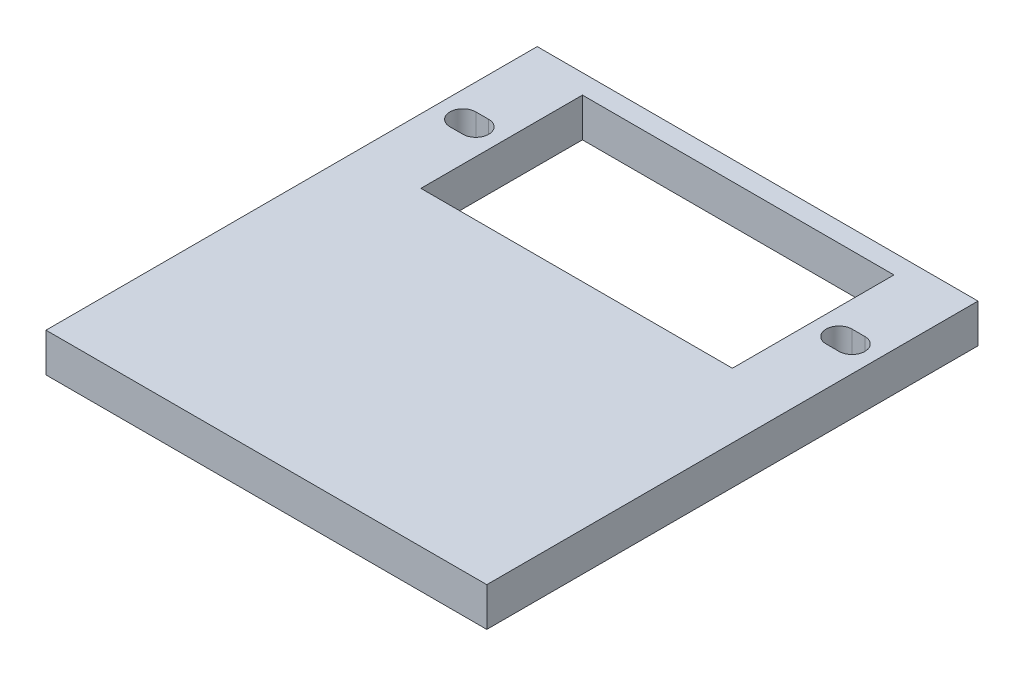
ISO-10303-21;
HEADER;
FILE_DESCRIPTION(('STEP AP214'),'2;1');
FILE_NAME('part.step','',(''),(''),'','','');
FILE_SCHEMA(('AUTOMOTIVE_DESIGN { 1 0 10303 214 1 1 1 1 }'));
ENDSEC;
DATA;
#1=APPLICATION_CONTEXT('core data for automotive mechanical design processes');
#2=APPLICATION_PROTOCOL_DEFINITION('international standard','automotive_design',2000,#1);
#3=PRODUCT_CONTEXT('',#1,'mechanical');
#4=PRODUCT('Part','Part','',(#3));
#5=PRODUCT_RELATED_PRODUCT_CATEGORY('part','',(#4));
#6=PRODUCT_DEFINITION_FORMATION('','',#4);
#7=PRODUCT_DEFINITION_CONTEXT('part definition',#1,'design');
#8=PRODUCT_DEFINITION('design','',#6,#7);
#9=PRODUCT_DEFINITION_SHAPE('','',#8);
#10=(LENGTH_UNIT() NAMED_UNIT(*) SI_UNIT(.MILLI.,.METRE.));
#11=(NAMED_UNIT(*) PLANE_ANGLE_UNIT() SI_UNIT($,.RADIAN.));
#12=(NAMED_UNIT(*) SI_UNIT($,.STERADIAN.) SOLID_ANGLE_UNIT());
#13=UNCERTAINTY_MEASURE_WITH_UNIT(LENGTH_MEASURE(1.E-05),#10,'distance_accuracy_value','');
#14=(GEOMETRIC_REPRESENTATION_CONTEXT(3) GLOBAL_UNCERTAINTY_ASSIGNED_CONTEXT((#13)) GLOBAL_UNIT_ASSIGNED_CONTEXT((#10,
#11,#12)) REPRESENTATION_CONTEXT('',''));
#15=CARTESIAN_POINT('',(0.,0.,0.));
#16=DIRECTION('',(0.,0.,1.));
#17=DIRECTION('',(1.,0.,0.));
#18=AXIS2_PLACEMENT_3D('',#15,#16,#17);
#19=CARTESIAN_POINT('',(0.,3.,-24.));
#20=DIRECTION('',(0.,0.,1.));
#21=DIRECTION('',(1.,0.,0.));
#22=AXIS2_PLACEMENT_3D('',#19,#20,#21);
#23=PLANE('',#22);
#24=DIRECTION('',(-1.,0.,0.));
#25=VECTOR('',#24,1.);
#26=CARTESIAN_POINT('',(0.,0.,-24.));
#27=LINE('',#26,#25);
#28=CARTESIAN_POINT('',(12.05,0.,-24.));
#29=VERTEX_POINT('',#28);
#30=CARTESIAN_POINT('',(-12.05,0.,-24.));
#31=VERTEX_POINT('',#30);
#32=EDGE_CURVE('E161',#29,#31,#27,.T.);
#33=ORIENTED_EDGE('',*,*,#32,.T.);
#34=DIRECTION('',(0.,-1.,0.));
#35=VECTOR('',#34,1.);
#36=CARTESIAN_POINT('',(-12.05,3.,-24.));
#37=LINE('',#36,#35);
#38=CARTESIAN_POINT('',(-12.05,3.,-24.));
#39=VERTEX_POINT('',#38);
#40=EDGE_CURVE('E11',#39,#31,#37,.T.);
#41=ORIENTED_EDGE('',*,*,#40,.F.);
#42=DIRECTION('',(-1.,0.,0.));
#43=VECTOR('',#42,1.);
#44=CARTESIAN_POINT('',(0.,3.,-24.));
#45=LINE('',#44,#43);
#46=CARTESIAN_POINT('',(12.05,3.,-24.));
#47=VERTEX_POINT('',#46);
#48=EDGE_CURVE('E131',#47,#39,#45,.T.);
#49=ORIENTED_EDGE('',*,*,#48,.F.);
#50=DIRECTION('',(0.,-1.,0.));
#51=VECTOR('',#50,1.);
#52=CARTESIAN_POINT('',(12.05,3.,-24.));
#53=LINE('',#52,#51);
#54=EDGE_CURVE('E211',#47,#29,#53,.T.);
#55=ORIENTED_EDGE('',*,*,#54,.T.);
#56=EDGE_LOOP('',(#33,#41,#49,#55));
#57=FACE_BOUND('',#56,.T.);
#58=ADVANCED_FACE('F35',(#57),#23,.F.);
#59=CARTESIAN_POINT('',(-12.05,3.,0.));
#60=DIRECTION('',(1.,0.,0.));
#61=DIRECTION('',(0.,0.,-1.));
#62=AXIS2_PLACEMENT_3D('',#59,#60,#61);
#63=PLANE('',#62);
#64=DIRECTION('',(0.,0.,1.));
#65=VECTOR('',#64,1.);
#66=CARTESIAN_POINT('',(-12.05,0.,0.));
#67=LINE('',#66,#65);
#68=CARTESIAN_POINT('',(-12.05,0.,-36.5));
#69=VERTEX_POINT('',#68);
#70=EDGE_CURVE('E116',#69,#31,#67,.T.);
#71=ORIENTED_EDGE('',*,*,#70,.F.);
#72=DIRECTION('',(0.,-1.,0.));
#73=VECTOR('',#72,1.);
#74=CARTESIAN_POINT('',(-12.05,3.,-36.5));
#75=LINE('',#74,#73);
#76=CARTESIAN_POINT('',(-12.05,3.,-36.5));
#77=VERTEX_POINT('',#76);
#78=EDGE_CURVE('E45',#77,#69,#75,.T.);
#79=ORIENTED_EDGE('',*,*,#78,.F.);
#80=DIRECTION('',(0.,0.,1.));
#81=VECTOR('',#80,1.);
#82=CARTESIAN_POINT('',(-12.05,3.,0.));
#83=LINE('',#82,#81);
#84=EDGE_CURVE('E114',#77,#39,#83,.T.);
#85=ORIENTED_EDGE('',*,*,#84,.T.);
#86=ORIENTED_EDGE('',*,*,#40,.T.);
#87=EDGE_LOOP('',(#71,#79,#85,#86));
#88=FACE_BOUND('',#87,.T.);
#89=ADVANCED_FACE('F113',(#88),#63,.T.);
#90=CARTESIAN_POINT('',(0.,3.,-36.5));
#91=DIRECTION('',(0.,0.,1.));
#92=DIRECTION('',(1.,0.,0.));
#93=AXIS2_PLACEMENT_3D('',#90,#91,#92);
#94=PLANE('',#93);
#95=DIRECTION('',(-1.,0.,0.));
#96=VECTOR('',#95,1.);
#97=CARTESIAN_POINT('',(0.,0.,-36.5));
#98=LINE('',#97,#96);
#99=CARTESIAN_POINT('',(12.05,0.,-36.5));
#100=VERTEX_POINT('',#99);
#101=EDGE_CURVE('E165',#100,#69,#98,.T.);
#102=ORIENTED_EDGE('',*,*,#101,.F.);
#103=DIRECTION('',(0.,-1.,0.));
#104=VECTOR('',#103,1.);
#105=CARTESIAN_POINT('',(12.05,3.,-36.5));
#106=LINE('',#105,#104);
#107=CARTESIAN_POINT('',(12.05,3.,-36.5));
#108=VERTEX_POINT('',#107);
#109=EDGE_CURVE('E137',#108,#100,#106,.T.);
#110=ORIENTED_EDGE('',*,*,#109,.F.);
#111=DIRECTION('',(-1.,0.,0.));
#112=VECTOR('',#111,1.);
#113=CARTESIAN_POINT('',(0.,3.,-36.5));
#114=LINE('',#113,#112);
#115=EDGE_CURVE('E128',#108,#77,#114,.T.);
#116=ORIENTED_EDGE('',*,*,#115,.T.);
#117=ORIENTED_EDGE('',*,*,#78,.T.);
#118=EDGE_LOOP('',(#102,#110,#116,#117));
#119=FACE_BOUND('',#118,.T.);
#120=ADVANCED_FACE('F135',(#119),#94,.T.);
#121=CARTESIAN_POINT('',(0.,3.,-38.));
#122=DIRECTION('',(0.,0.,1.));
#123=DIRECTION('',(1.,0.,0.));
#124=AXIS2_PLACEMENT_3D('',#121,#122,#123);
#125=PLANE('',#124);
#126=DIRECTION('',(-1.,0.,0.));
#127=VECTOR('',#126,1.);
#128=CARTESIAN_POINT('',(0.,0.,-38.));
#129=LINE('',#128,#127);
#130=CARTESIAN_POINT('',(17.05,0.,-38.));
#131=VERTEX_POINT('',#130);
#132=CARTESIAN_POINT('',(-17.05,0.,-38.));
#133=VERTEX_POINT('',#132);
#134=EDGE_CURVE('E167',#131,#133,#129,.T.);
#135=ORIENTED_EDGE('',*,*,#134,.T.);
#136=DIRECTION('',(0.,-1.,0.));
#137=VECTOR('',#136,1.);
#138=CARTESIAN_POINT('',(-17.05,3.,-38.));
#139=LINE('',#138,#137);
#140=CARTESIAN_POINT('',(-17.05,3.,-38.));
#141=VERTEX_POINT('',#140);
#142=EDGE_CURVE('E81',#141,#133,#139,.T.);
#143=ORIENTED_EDGE('',*,*,#142,.F.);
#144=DIRECTION('',(-1.,0.,0.));
#145=VECTOR('',#144,1.);
#146=CARTESIAN_POINT('',(0.,3.,-38.));
#147=LINE('',#146,#145);
#148=CARTESIAN_POINT('',(17.05,3.,-38.));
#149=VERTEX_POINT('',#148);
#150=EDGE_CURVE('E138',#149,#141,#147,.T.);
#151=ORIENTED_EDGE('',*,*,#150,.F.);
#152=DIRECTION('',(0.,-1.,0.));
#153=VECTOR('',#152,1.);
#154=CARTESIAN_POINT('',(17.05,3.,-38.));
#155=LINE('',#154,#153);
#156=EDGE_CURVE('E224',#149,#131,#155,.T.);
#157=ORIENTED_EDGE('',*,*,#156,.T.);
#158=EDGE_LOOP('',(#135,#143,#151,#157));
#159=FACE_BOUND('',#158,.T.);
#160=ADVANCED_FACE('F348',(#159),#125,.F.);
#161=CARTESIAN_POINT('',(-17.05,3.,0.));
#162=DIRECTION('',(-1.,0.,0.));
#163=DIRECTION('',(0.,0.,1.));
#164=AXIS2_PLACEMENT_3D('',#161,#162,#163);
#165=PLANE('',#164);
#166=DIRECTION('',(0.,0.,-1.));
#167=VECTOR('',#166,1.);
#168=CARTESIAN_POINT('',(-17.05,0.,0.));
#169=LINE('',#168,#167);
#170=CARTESIAN_POINT('',(-17.05,0.,0.));
#171=VERTEX_POINT('',#170);
#172=EDGE_CURVE('E169',#171,#133,#169,.T.);
#173=ORIENTED_EDGE('',*,*,#172,.F.);
#174=DIRECTION('',(0.,-1.,0.));
#175=VECTOR('',#174,1.);
#176=CARTESIAN_POINT('',(-17.05,3.,0.));
#177=LINE('',#176,#175);
#178=CARTESIAN_POINT('',(-17.05,3.,0.));
#179=VERTEX_POINT('',#178);
#180=EDGE_CURVE('E54',#179,#171,#177,.T.);
#181=ORIENTED_EDGE('',*,*,#180,.F.);
#182=DIRECTION('',(0.,0.,-1.));
#183=VECTOR('',#182,1.);
#184=CARTESIAN_POINT('',(-17.05,3.,0.));
#185=LINE('',#184,#183);
#186=EDGE_CURVE('E140',#179,#141,#185,.T.);
#187=ORIENTED_EDGE('',*,*,#186,.T.);
#188=ORIENTED_EDGE('',*,*,#142,.T.);
#189=EDGE_LOOP('',(#173,#181,#187,#188));
#190=FACE_BOUND('',#189,.T.);
#191=ADVANCED_FACE('F344',(#190),#165,.T.);
#192=CARTESIAN_POINT('',(-14.05,3.,-30.25));
#193=DIRECTION('',(0.,-1.,0.));
#194=DIRECTION('',(0.,0.,-1.));
#195=AXIS2_PLACEMENT_3D('',#192,#193,#194);
#196=CYLINDRICAL_SURFACE('',#195,1.);
#197=CARTESIAN_POINT('',(-14.05,0.,-30.25));
#198=DIRECTION('',(0.,1.,0.));
#199=DIRECTION('',(0.,0.,1.));
#200=AXIS2_PLACEMENT_3D('',#197,#198,#199);
#201=CIRCLE('',#200,1.);
#202=CARTESIAN_POINT('',(-14.05,0.,-29.25));
#203=VERTEX_POINT('',#202);
#204=CARTESIAN_POINT('',(-14.05,0.,-31.25));
#205=VERTEX_POINT('',#204);
#206=EDGE_CURVE('E148',#203,#205,#201,.T.);
#207=ORIENTED_EDGE('',*,*,#206,.F.);
#208=DIRECTION('',(0.,-1.,0.));
#209=VECTOR('',#208,1.);
#210=CARTESIAN_POINT('',(-14.05,3.,-29.25));
#211=LINE('',#210,#209);
#212=CARTESIAN_POINT('',(-14.05,3.,-29.25));
#213=VERTEX_POINT('',#212);
#214=EDGE_CURVE('E39',#213,#203,#211,.T.);
#215=ORIENTED_EDGE('',*,*,#214,.F.);
#216=CARTESIAN_POINT('',(-14.05,3.,-30.25));
#217=DIRECTION('',(0.,1.,0.));
#218=DIRECTION('',(0.,0.,1.));
#219=AXIS2_PLACEMENT_3D('',#216,#217,#218);
#220=CIRCLE('',#219,1.);
#221=CARTESIAN_POINT('',(-14.05,3.,-31.25));
#222=VERTEX_POINT('',#221);
#223=EDGE_CURVE('E175',#213,#222,#220,.T.);
#224=ORIENTED_EDGE('',*,*,#223,.T.);
#225=DIRECTION('',(0.,-1.,0.));
#226=VECTOR('',#225,1.);
#227=CARTESIAN_POINT('',(-14.05,3.,-31.25));
#228=LINE('',#227,#226);
#229=EDGE_CURVE('E147',#222,#205,#228,.T.);
#230=ORIENTED_EDGE('',*,*,#229,.T.);
#231=EDGE_LOOP('',(#207,#215,#224,#230));
#232=FACE_BOUND('',#231,.T.);
#233=ADVANCED_FACE('F37',(#232),#196,.F.);
#234=CARTESIAN_POINT('',(1.01481323344643E-13,3.,-29.2499999999999));
#235=DIRECTION('',(0.,0.,-1.));
#236=DIRECTION('',(-1.,0.,0.));
#237=AXIS2_PLACEMENT_3D('',#234,#235,#236);
#238=PLANE('',#237);
#239=DIRECTION('',(1.,0.,0.));
#240=VECTOR('',#239,1.);
#241=CARTESIAN_POINT('',(1.01481323344643E-13,0.,-29.2499999999999));
#242=LINE('',#241,#240);
#243=CARTESIAN_POINT('',(-15.05,0.,-29.25));
#244=VERTEX_POINT('',#243);
#245=EDGE_CURVE('E151',#244,#203,#242,.T.);
#246=ORIENTED_EDGE('',*,*,#245,.F.);
#247=DIRECTION('',(0.,-1.,0.));
#248=VECTOR('',#247,1.);
#249=CARTESIAN_POINT('',(-15.05,3.,-29.25));
#250=LINE('',#249,#248);
#251=CARTESIAN_POINT('',(-15.05,3.,-29.25));
#252=VERTEX_POINT('',#251);
#253=EDGE_CURVE('E180',#252,#244,#250,.T.);
#254=ORIENTED_EDGE('',*,*,#253,.F.);
#255=DIRECTION('',(1.,0.,0.));
#256=VECTOR('',#255,1.);
#257=CARTESIAN_POINT('',(1.01481323344643E-13,3.,-29.2499999999999));
#258=LINE('',#257,#256);
#259=EDGE_CURVE('E189',#252,#213,#258,.T.);
#260=ORIENTED_EDGE('',*,*,#259,.T.);
#261=ORIENTED_EDGE('',*,*,#214,.T.);
#262=EDGE_LOOP('',(#246,#254,#260,#261));
#263=FACE_BOUND('',#262,.T.);
#264=ADVANCED_FACE('F187',(#263),#238,.T.);
#265=CARTESIAN_POINT('',(-15.05,3.,-30.25));
#266=DIRECTION('',(0.,-1.,0.));
#267=DIRECTION('',(0.,0.,-1.));
#268=AXIS2_PLACEMENT_3D('',#265,#266,#267);
#269=CYLINDRICAL_SURFACE('',#268,1.);
#270=CARTESIAN_POINT('',(-15.05,0.,-30.25));
#271=DIRECTION('',(0.,1.,0.));
#272=DIRECTION('',(0.,0.,1.));
#273=AXIS2_PLACEMENT_3D('',#270,#271,#272);
#274=CIRCLE('',#273,1.);
#275=CARTESIAN_POINT('',(-15.05,0.,-31.25));
#276=VERTEX_POINT('',#275);
#277=EDGE_CURVE('E155',#276,#244,#274,.T.);
#278=ORIENTED_EDGE('',*,*,#277,.F.);
#279=DIRECTION('',(0.,-1.,0.));
#280=VECTOR('',#279,1.);
#281=CARTESIAN_POINT('',(-15.05,3.,-31.25));
#282=LINE('',#281,#280);
#283=CARTESIAN_POINT('',(-15.05,3.,-31.25));
#284=VERTEX_POINT('',#283);
#285=EDGE_CURVE('E179',#284,#276,#282,.T.);
#286=ORIENTED_EDGE('',*,*,#285,.F.);
#287=CARTESIAN_POINT('',(-15.05,3.,-30.25));
#288=DIRECTION('',(0.,1.,0.));
#289=DIRECTION('',(0.,0.,1.));
#290=AXIS2_PLACEMENT_3D('',#287,#288,#289);
#291=CIRCLE('',#290,1.);
#292=EDGE_CURVE('E198',#284,#252,#291,.T.);
#293=ORIENTED_EDGE('',*,*,#292,.T.);
#294=ORIENTED_EDGE('',*,*,#253,.T.);
#295=EDGE_LOOP('',(#278,#286,#293,#294));
#296=FACE_BOUND('',#295,.T.);
#297=ADVANCED_FACE('F195',(#296),#269,.F.);
#298=CARTESIAN_POINT('',(-1.08420217248551E-13,3.,-31.25));
#299=DIRECTION('',(0.,0.,-1.));
#300=DIRECTION('',(-1.,0.,0.));
#301=AXIS2_PLACEMENT_3D('',#298,#299,#300);
#302=PLANE('',#301);
#303=DIRECTION('',(1.,0.,0.));
#304=VECTOR('',#303,1.);
#305=CARTESIAN_POINT('',(-1.08420217248551E-13,0.,-31.25));
#306=LINE('',#305,#304);
#307=EDGE_CURVE('E158',#276,#205,#306,.T.);
#308=ORIENTED_EDGE('',*,*,#307,.T.);
#309=ORIENTED_EDGE('',*,*,#229,.F.);
#310=DIRECTION('',(1.,0.,0.));
#311=VECTOR('',#310,1.);
#312=CARTESIAN_POINT('',(-1.08420217248551E-13,3.,-31.25));
#313=LINE('',#312,#311);
#314=EDGE_CURVE('E200',#284,#222,#313,.T.);
#315=ORIENTED_EDGE('',*,*,#314,.F.);
#316=ORIENTED_EDGE('',*,*,#285,.T.);
#317=EDGE_LOOP('',(#308,#309,#315,#316));
#318=FACE_BOUND('',#317,.T.);
#319=ADVANCED_FACE('F201',(#318),#302,.F.);
#320=CARTESIAN_POINT('',(0.,3.,0.));
#321=DIRECTION('',(0.,0.,1.));
#322=DIRECTION('',(1.,0.,0.));
#323=AXIS2_PLACEMENT_3D('',#320,#321,#322);
#324=PLANE('',#323);
#325=DIRECTION('',(-1.,0.,0.));
#326=VECTOR('',#325,1.);
#327=CARTESIAN_POINT('',(0.,0.,0.));
#328=LINE('',#327,#326);
#329=CARTESIAN_POINT('',(17.05,0.,0.));
#330=VERTEX_POINT('',#329);
#331=EDGE_CURVE('E172',#330,#171,#328,.T.);
#332=ORIENTED_EDGE('',*,*,#331,.F.);
#333=DIRECTION('',(0.,-1.,0.));
#334=VECTOR('',#333,1.);
#335=CARTESIAN_POINT('',(17.05,3.,0.));
#336=LINE('',#335,#334);
#337=CARTESIAN_POINT('',(17.05,3.,0.));
#338=VERTEX_POINT('',#337);
#339=EDGE_CURVE('E152',#338,#330,#336,.T.);
#340=ORIENTED_EDGE('',*,*,#339,.F.);
#341=DIRECTION('',(-1.,0.,0.));
#342=VECTOR('',#341,1.);
#343=CARTESIAN_POINT('',(0.,3.,0.));
#344=LINE('',#343,#342);
#345=EDGE_CURVE('E145',#338,#179,#344,.T.);
#346=ORIENTED_EDGE('',*,*,#345,.T.);
#347=ORIENTED_EDGE('',*,*,#180,.T.);
#348=EDGE_LOOP('',(#332,#340,#346,#347));
#349=FACE_BOUND('',#348,.T.);
#350=ADVANCED_FACE('F338',(#349),#324,.T.);
#351=CARTESIAN_POINT('',(0.,3.,0.));
#352=DIRECTION('',(0.,1.,0.));
#353=DIRECTION('',(0.,0.,1.));
#354=AXIS2_PLACEMENT_3D('',#351,#352,#353);
#355=PLANE('',#354);
#356=DIRECTION('',(0.,0.,1.));
#357=VECTOR('',#356,1.);
#358=CARTESIAN_POINT('',(12.05,3.,0.));
#359=LINE('',#358,#357);
#360=EDGE_CURVE('E221',#108,#47,#359,.T.);
#361=ORIENTED_EDGE('',*,*,#360,.T.);
#362=ORIENTED_EDGE('',*,*,#48,.T.);
#363=ORIENTED_EDGE('',*,*,#84,.F.);
#364=ORIENTED_EDGE('',*,*,#115,.F.);
#365=EDGE_LOOP('',(#361,#362,#363,#364));
#366=FACE_BOUND('',#365,.T.);
#367=ORIENTED_EDGE('',*,*,#223,.F.);
#368=ORIENTED_EDGE('',*,*,#259,.F.);
#369=ORIENTED_EDGE('',*,*,#292,.F.);
#370=ORIENTED_EDGE('',*,*,#314,.T.);
#371=EDGE_LOOP('',(#367,#368,#369,#370));
#372=FACE_BOUND('',#371,.T.);
#373=ORIENTED_EDGE('',*,*,#345,.F.);
#374=DIRECTION('',(0.,0.,-1.));
#375=VECTOR('',#374,1.);
#376=CARTESIAN_POINT('',(17.05,3.,0.));
#377=LINE('',#376,#375);
#378=EDGE_CURVE('E250',#338,#149,#377,.T.);
#379=ORIENTED_EDGE('',*,*,#378,.T.);
#380=ORIENTED_EDGE('',*,*,#150,.T.);
#381=ORIENTED_EDGE('',*,*,#186,.F.);
#382=EDGE_LOOP('',(#373,#379,#380,#381));
#383=FACE_BOUND('',#382,.T.);
#384=CARTESIAN_POINT('',(14.05,3.,-30.25));
#385=DIRECTION('',(0.,-1.,0.));
#386=DIRECTION('',(0.,0.,1.));
#387=AXIS2_PLACEMENT_3D('',#384,#385,#386);
#388=CIRCLE('',#387,1.);
#389=CARTESIAN_POINT('',(14.05,3.,-29.25));
#390=VERTEX_POINT('',#389);
#391=CARTESIAN_POINT('',(14.05,3.,-31.25));
#392=VERTEX_POINT('',#391);
#393=EDGE_CURVE('E233',#390,#392,#388,.T.);
#394=ORIENTED_EDGE('',*,*,#393,.T.);
#395=DIRECTION('',(-1.,0.,0.));
#396=VECTOR('',#395,1.);
#397=CARTESIAN_POINT('',(1.08420217248551E-13,3.,-31.25));
#398=LINE('',#397,#396);
#399=CARTESIAN_POINT('',(15.05,3.,-31.25));
#400=VERTEX_POINT('',#399);
#401=EDGE_CURVE('E259',#400,#392,#398,.T.);
#402=ORIENTED_EDGE('',*,*,#401,.F.);
#403=CARTESIAN_POINT('',(15.05,3.,-30.25));
#404=DIRECTION('',(0.,-1.,0.));
#405=DIRECTION('',(0.,0.,1.));
#406=AXIS2_PLACEMENT_3D('',#403,#404,#405);
#407=CIRCLE('',#406,1.);
#408=CARTESIAN_POINT('',(15.05,3.,-29.25));
#409=VERTEX_POINT('',#408);
#410=EDGE_CURVE('E256',#400,#409,#407,.T.);
#411=ORIENTED_EDGE('',*,*,#410,.T.);
#412=DIRECTION('',(-1.,0.,0.));
#413=VECTOR('',#412,1.);
#414=CARTESIAN_POINT('',(-1.01481323344643E-13,3.,-29.2499999999999));
#415=LINE('',#414,#413);
#416=EDGE_CURVE('E253',#409,#390,#415,.T.);
#417=ORIENTED_EDGE('',*,*,#416,.T.);
#418=EDGE_LOOP('',(#394,#402,#411,#417));
#419=FACE_BOUND('',#418,.T.);
#420=ADVANCED_FACE('F125',(#366,#372,#383,#419),#355,.T.);
#421=CARTESIAN_POINT('',(0.,0.,0.));
#422=DIRECTION('',(0.,1.,0.));
#423=DIRECTION('',(0.,0.,1.));
#424=AXIS2_PLACEMENT_3D('',#421,#422,#423);
#425=PLANE('',#424);
#426=ORIENTED_EDGE('',*,*,#32,.F.);
#427=DIRECTION('',(0.,0.,1.));
#428=VECTOR('',#427,1.);
#429=CARTESIAN_POINT('',(12.05,0.,0.));
#430=LINE('',#429,#428);
#431=EDGE_CURVE('E230',#100,#29,#430,.T.);
#432=ORIENTED_EDGE('',*,*,#431,.F.);
#433=ORIENTED_EDGE('',*,*,#101,.T.);
#434=ORIENTED_EDGE('',*,*,#70,.T.);
#435=EDGE_LOOP('',(#426,#432,#433,#434));
#436=FACE_BOUND('',#435,.T.);
#437=ORIENTED_EDGE('',*,*,#206,.T.);
#438=ORIENTED_EDGE('',*,*,#307,.F.);
#439=ORIENTED_EDGE('',*,*,#277,.T.);
#440=ORIENTED_EDGE('',*,*,#245,.T.);
#441=EDGE_LOOP('',(#437,#438,#439,#440));
#442=FACE_BOUND('',#441,.T.);
#443=DIRECTION('',(0.,0.,-1.));
#444=VECTOR('',#443,1.);
#445=CARTESIAN_POINT('',(17.05,0.,0.));
#446=LINE('',#445,#444);
#447=EDGE_CURVE('E234',#330,#131,#446,.T.);
#448=ORIENTED_EDGE('',*,*,#447,.F.);
#449=ORIENTED_EDGE('',*,*,#331,.T.);
#450=ORIENTED_EDGE('',*,*,#172,.T.);
#451=ORIENTED_EDGE('',*,*,#134,.F.);
#452=EDGE_LOOP('',(#448,#449,#450,#451));
#453=FACE_BOUND('',#452,.T.);
#454=CARTESIAN_POINT('',(14.05,0.,-30.25));
#455=DIRECTION('',(0.,-1.,0.));
#456=DIRECTION('',(0.,0.,1.));
#457=AXIS2_PLACEMENT_3D('',#454,#455,#456);
#458=CIRCLE('',#457,1.);
#459=CARTESIAN_POINT('',(14.05,0.,-29.25));
#460=VERTEX_POINT('',#459);
#461=CARTESIAN_POINT('',(14.05,0.,-31.25));
#462=VERTEX_POINT('',#461);
#463=EDGE_CURVE('E246',#460,#462,#458,.T.);
#464=ORIENTED_EDGE('',*,*,#463,.F.);
#465=DIRECTION('',(-1.,0.,0.));
#466=VECTOR('',#465,1.);
#467=CARTESIAN_POINT('',(-1.01481323344643E-13,0.,-29.2499999999999));
#468=LINE('',#467,#466);
#469=CARTESIAN_POINT('',(15.05,0.,-29.25));
#470=VERTEX_POINT('',#469);
#471=EDGE_CURVE('E237',#470,#460,#468,.T.);
#472=ORIENTED_EDGE('',*,*,#471,.F.);
#473=CARTESIAN_POINT('',(15.05,0.,-30.25));
#474=DIRECTION('',(0.,-1.,0.));
#475=DIRECTION('',(0.,0.,1.));
#476=AXIS2_PLACEMENT_3D('',#473,#474,#475);
#477=CIRCLE('',#476,1.);
#478=CARTESIAN_POINT('',(15.05,0.,-31.25));
#479=VERTEX_POINT('',#478);
#480=EDGE_CURVE('E240',#479,#470,#477,.T.);
#481=ORIENTED_EDGE('',*,*,#480,.F.);
#482=DIRECTION('',(-1.,0.,0.));
#483=VECTOR('',#482,1.);
#484=CARTESIAN_POINT('',(1.08420217248551E-13,0.,-31.25));
#485=LINE('',#484,#483);
#486=EDGE_CURVE('E243',#479,#462,#485,.T.);
#487=ORIENTED_EDGE('',*,*,#486,.T.);
#488=EDGE_LOOP('',(#464,#472,#481,#487));
#489=FACE_BOUND('',#488,.T.);
#490=ADVANCED_FACE('F193',(#436,#442,#453,#489),#425,.F.);
#491=CARTESIAN_POINT('',(17.05,3.,0.));
#492=DIRECTION('',(-1.,0.,0.));
#493=DIRECTION('',(0.,0.,1.));
#494=AXIS2_PLACEMENT_3D('',#491,#492,#493);
#495=PLANE('',#494);
#496=ORIENTED_EDGE('',*,*,#447,.T.);
#497=ORIENTED_EDGE('',*,*,#156,.F.);
#498=ORIENTED_EDGE('',*,*,#378,.F.);
#499=ORIENTED_EDGE('',*,*,#339,.T.);
#500=EDGE_LOOP('',(#496,#497,#498,#499));
#501=FACE_BOUND('',#500,.T.);
#502=ADVANCED_FACE('F319',(#501),#495,.F.);
#503=CARTESIAN_POINT('',(12.05,3.,0.));
#504=DIRECTION('',(1.,0.,0.));
#505=DIRECTION('',(0.,0.,-1.));
#506=AXIS2_PLACEMENT_3D('',#503,#504,#505);
#507=PLANE('',#506);
#508=ORIENTED_EDGE('',*,*,#431,.T.);
#509=ORIENTED_EDGE('',*,*,#54,.F.);
#510=ORIENTED_EDGE('',*,*,#360,.F.);
#511=ORIENTED_EDGE('',*,*,#109,.T.);
#512=EDGE_LOOP('',(#508,#509,#510,#511));
#513=FACE_BOUND('',#512,.T.);
#514=ADVANCED_FACE('F317',(#513),#507,.F.);
#515=CARTESIAN_POINT('',(14.05,3.,-30.25));
#516=DIRECTION('',(0.,-1.,0.));
#517=DIRECTION('',(0.,0.,-1.));
#518=AXIS2_PLACEMENT_3D('',#515,#516,#517);
#519=CYLINDRICAL_SURFACE('',#518,1.);
#520=ORIENTED_EDGE('',*,*,#463,.T.);
#521=DIRECTION('',(0.,-1.,0.));
#522=VECTOR('',#521,1.);
#523=CARTESIAN_POINT('',(14.05,3.,-31.25));
#524=LINE('',#523,#522);
#525=EDGE_CURVE('E208',#392,#462,#524,.T.);
#526=ORIENTED_EDGE('',*,*,#525,.F.);
#527=ORIENTED_EDGE('',*,*,#393,.F.);
#528=DIRECTION('',(0.,-1.,0.));
#529=VECTOR('',#528,1.);
#530=CARTESIAN_POINT('',(14.05,3.,-29.25));
#531=LINE('',#530,#529);
#532=EDGE_CURVE('E218',#390,#460,#531,.T.);
#533=ORIENTED_EDGE('',*,*,#532,.T.);
#534=EDGE_LOOP('',(#520,#526,#527,#533));
#535=FACE_BOUND('',#534,.T.);
#536=ADVANCED_FACE('F274',(#535),#519,.F.);
#537=CARTESIAN_POINT('',(1.08420217248551E-13,3.,-31.25));
#538=DIRECTION('',(0.,0.,1.));
#539=DIRECTION('',(1.,0.,0.));
#540=AXIS2_PLACEMENT_3D('',#537,#538,#539);
#541=PLANE('',#540);
#542=ORIENTED_EDGE('',*,*,#486,.F.);
#543=DIRECTION('',(0.,-1.,0.));
#544=VECTOR('',#543,1.);
#545=CARTESIAN_POINT('',(15.05,3.,-31.25));
#546=LINE('',#545,#544);
#547=EDGE_CURVE('E212',#400,#479,#546,.T.);
#548=ORIENTED_EDGE('',*,*,#547,.F.);
#549=ORIENTED_EDGE('',*,*,#401,.T.);
#550=ORIENTED_EDGE('',*,*,#525,.T.);
#551=EDGE_LOOP('',(#542,#548,#549,#550));
#552=FACE_BOUND('',#551,.T.);
#553=ADVANCED_FACE('F280',(#552),#541,.T.);
#554=CARTESIAN_POINT('',(15.05,3.,-30.25));
#555=DIRECTION('',(0.,-1.,0.));
#556=DIRECTION('',(0.,0.,-1.));
#557=AXIS2_PLACEMENT_3D('',#554,#555,#556);
#558=CYLINDRICAL_SURFACE('',#557,1.);
#559=ORIENTED_EDGE('',*,*,#480,.T.);
#560=DIRECTION('',(0.,-1.,0.));
#561=VECTOR('',#560,1.);
#562=CARTESIAN_POINT('',(15.05,3.,-29.25));
#563=LINE('',#562,#561);
#564=EDGE_CURVE('E215',#409,#470,#563,.T.);
#565=ORIENTED_EDGE('',*,*,#564,.F.);
#566=ORIENTED_EDGE('',*,*,#410,.F.);
#567=ORIENTED_EDGE('',*,*,#547,.T.);
#568=EDGE_LOOP('',(#559,#565,#566,#567));
#569=FACE_BOUND('',#568,.T.);
#570=ADVANCED_FACE('F288',(#569),#558,.F.);
#571=CARTESIAN_POINT('',(-1.01481323344643E-13,3.,-29.2499999999999));
#572=DIRECTION('',(0.,0.,1.));
#573=DIRECTION('',(1.,0.,0.));
#574=AXIS2_PLACEMENT_3D('',#571,#572,#573);
#575=PLANE('',#574);
#576=ORIENTED_EDGE('',*,*,#471,.T.);
#577=ORIENTED_EDGE('',*,*,#532,.F.);
#578=ORIENTED_EDGE('',*,*,#416,.F.);
#579=ORIENTED_EDGE('',*,*,#564,.T.);
#580=EDGE_LOOP('',(#576,#577,#578,#579));
#581=FACE_BOUND('',#580,.T.);
#582=ADVANCED_FACE('F425',(#581),#575,.F.);
#583=CLOSED_SHELL('',(#58,#89,#120,#160,#191,#233,#264,#297,#319,#350,#420,#490,#502,#514,#536,
#553,#570,#582));
#584=MANIFOLD_SOLID_BREP('B2',#583);
#585=ADVANCED_BREP_SHAPE_REPRESENTATION('',(#18,#584),#14);
#586=SHAPE_DEFINITION_REPRESENTATION(#9,#585);
ENDSEC;
END-ISO-10303-21;
